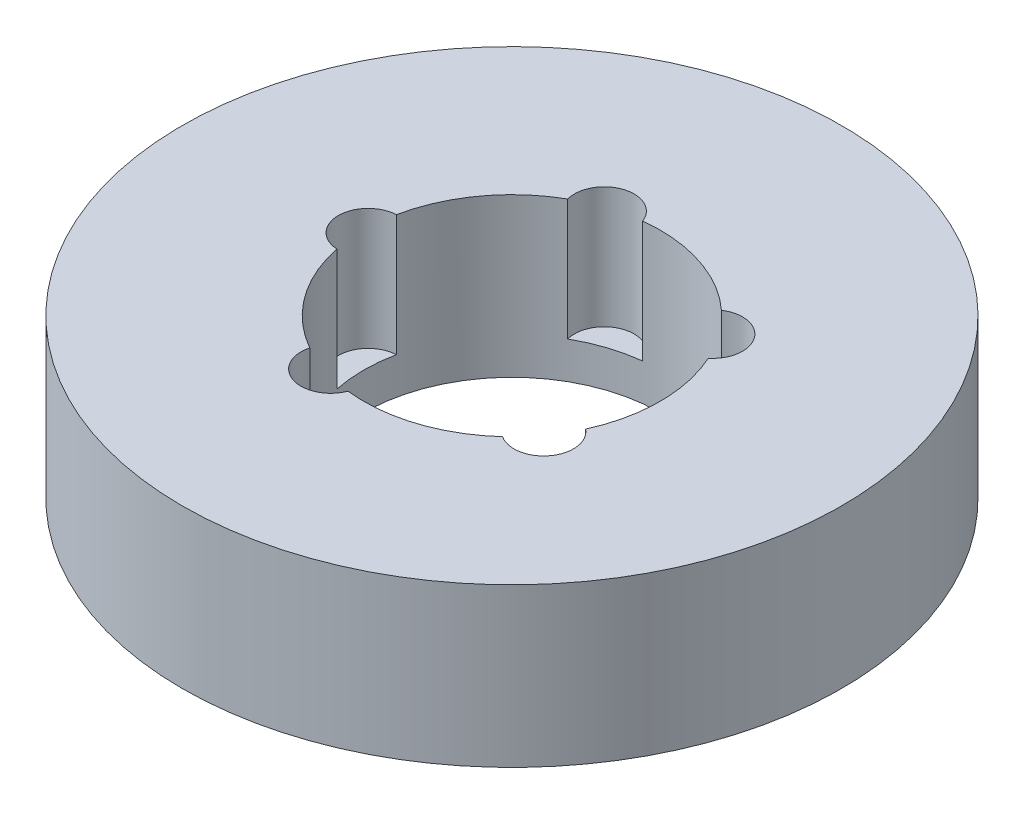
ISO-10303-21;
HEADER;
FILE_DESCRIPTION(('STEP AP214'),'2;1');
FILE_NAME('part.step','',(''),(''),'','','');
FILE_SCHEMA(('AUTOMOTIVE_DESIGN { 1 0 10303 214 1 1 1 1 }'));
ENDSEC;
DATA;
#1=APPLICATION_CONTEXT('core data for automotive mechanical design processes');
#2=APPLICATION_PROTOCOL_DEFINITION('international standard','automotive_design',2000,#1);
#3=PRODUCT_CONTEXT('',#1,'mechanical');
#4=PRODUCT('Part','Part','',(#3));
#5=PRODUCT_RELATED_PRODUCT_CATEGORY('part','',(#4));
#6=PRODUCT_DEFINITION_FORMATION('','',#4);
#7=PRODUCT_DEFINITION_CONTEXT('part definition',#1,'design');
#8=PRODUCT_DEFINITION('design','',#6,#7);
#9=PRODUCT_DEFINITION_SHAPE('','',#8);
#10=(LENGTH_UNIT() NAMED_UNIT(*) SI_UNIT(.MILLI.,.METRE.));
#11=(NAMED_UNIT(*) PLANE_ANGLE_UNIT() SI_UNIT($,.RADIAN.));
#12=(NAMED_UNIT(*) SI_UNIT($,.STERADIAN.) SOLID_ANGLE_UNIT());
#13=UNCERTAINTY_MEASURE_WITH_UNIT(LENGTH_MEASURE(1.E-05),#10,'distance_accuracy_value','');
#14=(GEOMETRIC_REPRESENTATION_CONTEXT(3) GLOBAL_UNCERTAINTY_ASSIGNED_CONTEXT((#13)) GLOBAL_UNIT_ASSIGNED_CONTEXT((#10,
#11,#12)) REPRESENTATION_CONTEXT('',''));
#15=CARTESIAN_POINT('',(0.,0.,0.));
#16=DIRECTION('',(0.,0.,1.));
#17=DIRECTION('',(1.,0.,0.));
#18=AXIS2_PLACEMENT_3D('',#15,#16,#17);
#19=CARTESIAN_POINT('',(0.,24.,0.));
#20=DIRECTION('',(0.,-1.,0.));
#21=DIRECTION('',(0.,0.,-1.));
#22=AXIS2_PLACEMENT_3D('',#19,#20,#21);
#23=CYLINDRICAL_SURFACE('',#22,50.);
#24=CARTESIAN_POINT('',(0.,24.,0.));
#25=DIRECTION('',(0.,1.,0.));
#26=DIRECTION('',(0.,0.,1.));
#27=AXIS2_PLACEMENT_3D('',#24,#25,#26);
#28=CIRCLE('',#27,50.);
#29=CARTESIAN_POINT('',(0.,24.,50.));
#30=VERTEX_POINT('',#29);
#31=EDGE_CURVE('E151',#30,#30,#28,.T.);
#32=ORIENTED_EDGE('',*,*,#31,.F.);
#33=EDGE_LOOP('',(#32));
#34=FACE_BOUND('',#33,.T.);
#35=CARTESIAN_POINT('',(0.,0.,0.));
#36=DIRECTION('',(0.,1.,0.));
#37=DIRECTION('',(0.,0.,1.));
#38=AXIS2_PLACEMENT_3D('',#35,#36,#37);
#39=CIRCLE('',#38,50.);
#40=CARTESIAN_POINT('',(0.,0.,50.));
#41=VERTEX_POINT('',#40);
#42=EDGE_CURVE('E150',#41,#41,#39,.T.);
#43=ORIENTED_EDGE('',*,*,#42,.T.);
#44=EDGE_LOOP('',(#43));
#45=FACE_BOUND('',#44,.T.);
#46=ADVANCED_FACE('F39',(#34,#45),#23,.T.);
#47=CARTESIAN_POINT('',(0.,24.,0.));
#48=DIRECTION('',(0.,1.,0.));
#49=DIRECTION('',(0.,0.,1.));
#50=AXIS2_PLACEMENT_3D('',#47,#48,#49);
#51=PLANE('',#50);
#52=CARTESIAN_POINT('',(-6.74144347513201,24.,-20.7480296002105));
#53=DIRECTION('',(0.,1.,0.));
#54=DIRECTION('',(-0.95105651629515,0.,0.309016994374958));
#55=AXIS2_PLACEMENT_3D('',#52,#53,#54);
#56=CIRCLE('',#55,4.51957308075142);
#57=CARTESIAN_POINT('',(-2.51857487786858,24.,-22.358595228336));
#58=VERTEX_POINT('',#57);
#59=CARTESIAN_POINT('',(-11.1044826593917,24.,-19.5688646800796));
#60=VERTEX_POINT('',#59);
#61=EDGE_CURVE('E196',#58,#60,#56,.T.);
#62=ORIENTED_EDGE('',*,*,#61,.F.);
#63=CARTESIAN_POINT('',(0.,24.,0.));
#64=DIRECTION('',(0.,1.,0.));
#65=DIRECTION('',(0.,0.,1.));
#66=AXIS2_PLACEMENT_3D('',#63,#64,#65);
#67=CIRCLE('',#66,22.5);
#68=CARTESIAN_POINT('',(15.1796224149939,24.,-16.6081023400693));
#69=VERTEX_POINT('',#68);
#70=EDGE_CURVE('E156',#69,#58,#67,.T.);
#71=ORIENTED_EDGE('',*,*,#70,.F.);
#72=CARTESIAN_POINT('',(17.6493281511311,24.,-12.8229874925192));
#73=DIRECTION('',(0.,1.,0.));
#74=DIRECTION('',(-0.58778525229248,0.,-0.809016994374942));
#75=AXIS2_PLACEMENT_3D('',#72,#73,#74);
#76=CIRCLE('',#75,4.51957308075142);
#77=CARTESIAN_POINT('',(20.4860052482475,24.,-9.30449294528056));
#78=VERTEX_POINT('',#77);
#79=EDGE_CURVE('E254',#78,#69,#76,.T.);
#80=ORIENTED_EDGE('',*,*,#79,.F.);
#81=CARTESIAN_POINT('',(20.4860052482476,24.,9.30449294528027));
#82=VERTEX_POINT('',#81);
#83=EDGE_CURVE('E153',#82,#78,#67,.T.);
#84=ORIENTED_EDGE('',*,*,#83,.F.);
#85=CARTESIAN_POINT('',(17.6493281511313,24.,12.8229874925189));
#86=DIRECTION('',(0.,1.,0.));
#87=DIRECTION('',(0.587785252292469,0.,-0.809016994374951));
#88=AXIS2_PLACEMENT_3D('',#85,#86,#87);
#89=CIRCLE('',#88,4.51957308075142);
#90=CARTESIAN_POINT('',(15.1796224149942,24.,16.6081023400691));
#91=VERTEX_POINT('',#90);
#92=EDGE_CURVE('E248',#91,#82,#89,.T.);
#93=ORIENTED_EDGE('',*,*,#92,.F.);
#94=CARTESIAN_POINT('',(-2.51857487786826,24.,22.358595228336));
#95=VERTEX_POINT('',#94);
#96=EDGE_CURVE('E140',#95,#91,#67,.T.);
#97=ORIENTED_EDGE('',*,*,#96,.F.);
#98=CARTESIAN_POINT('',(-6.74144347513171,24.,20.7480296002106));
#99=DIRECTION('',(0.,1.,0.));
#100=DIRECTION('',(0.951056516295155,0.,0.309016994374945));
#101=AXIS2_PLACEMENT_3D('',#98,#99,#100);
#102=CIRCLE('',#101,4.51957308075142);
#103=CARTESIAN_POINT('',(-11.1044826593914,24.,19.5688646800798));
#104=VERTEX_POINT('',#103);
#105=EDGE_CURVE('E117',#104,#95,#102,.T.);
#106=ORIENTED_EDGE('',*,*,#105,.F.);
#107=CARTESIAN_POINT('',(-22.0425701259818,24.,4.5138788465325));
#108=VERTEX_POINT('',#107);
#109=EDGE_CURVE('E133',#108,#104,#67,.T.);
#110=ORIENTED_EDGE('',*,*,#109,.F.);
#111=CARTESIAN_POINT('',(-21.8157693519988,24.,0.));
#112=DIRECTION('',(0.,1.,0.));
#113=DIRECTION('',(0.,0.,1.));
#114=AXIS2_PLACEMENT_3D('',#111,#112,#113);
#115=CIRCLE('',#114,4.51957308075142);
#116=CARTESIAN_POINT('',(-22.0425701259818,24.,-4.5138788465325));
#117=VERTEX_POINT('',#116);
#118=EDGE_CURVE('E170',#117,#108,#115,.T.);
#119=ORIENTED_EDGE('',*,*,#118,.F.);
#120=EDGE_CURVE('E149',#60,#117,#67,.T.);
#121=ORIENTED_EDGE('',*,*,#120,.F.);
#122=EDGE_LOOP('',(#62,#71,#80,#84,#93,#97,#106,#110,#119,#121));
#123=FACE_BOUND('',#122,.T.);
#124=ORIENTED_EDGE('',*,*,#31,.T.);
#125=EDGE_LOOP('',(#124));
#126=FACE_BOUND('',#125,.T.);
#127=ADVANCED_FACE('F131',(#123,#126),#51,.T.);
#128=CARTESIAN_POINT('',(0.,0.,0.));
#129=DIRECTION('',(0.,1.,0.));
#130=DIRECTION('',(0.,0.,1.));
#131=AXIS2_PLACEMENT_3D('',#128,#129,#130);
#132=PLANE('',#131);
#133=CARTESIAN_POINT('',(0.,0.,0.));
#134=DIRECTION('',(0.,1.,0.));
#135=DIRECTION('',(0.,0.,1.));
#136=AXIS2_PLACEMENT_3D('',#133,#134,#135);
#137=CIRCLE('',#136,22.5);
#138=CARTESIAN_POINT('',(0.,0.,22.5));
#139=VERTEX_POINT('',#138);
#140=EDGE_CURVE('E160',#139,#139,#137,.T.);
#141=ORIENTED_EDGE('',*,*,#140,.T.);
#142=EDGE_LOOP('',(#141));
#143=FACE_BOUND('',#142,.T.);
#144=ORIENTED_EDGE('',*,*,#42,.F.);
#145=EDGE_LOOP('',(#144));
#146=FACE_BOUND('',#145,.T.);
#147=ADVANCED_FACE('F212',(#143,#146),#132,.F.);
#148=CARTESIAN_POINT('',(0.,24.,0.));
#149=DIRECTION('',(0.,-1.,0.));
#150=DIRECTION('',(0.,0.,-1.));
#151=AXIS2_PLACEMENT_3D('',#148,#149,#150);
#152=CYLINDRICAL_SURFACE('',#151,22.5);
#153=DIRECTION('',(0.,1.,0.));
#154=VECTOR('',#153,1.);
#155=CARTESIAN_POINT('',(-2.51857487786858,14.802299616417,-22.358595228336));
#156=LINE('',#155,#154);
#157=CARTESIAN_POINT('',(-2.51857487786858,5.60459923283404,-22.358595228336));
#158=VERTEX_POINT('',#157);
#159=EDGE_CURVE('E11',#158,#58,#156,.T.);
#160=ORIENTED_EDGE('',*,*,#159,.F.);
#161=CARTESIAN_POINT('',(0.,5.60459923283404,0.));
#162=DIRECTION('',(0.,1.,0.));
#163=DIRECTION('',(0.,0.,1.));
#164=AXIS2_PLACEMENT_3D('',#161,#162,#163);
#165=CIRCLE('',#164,22.5);
#166=CARTESIAN_POINT('',(-11.1044826593917,5.60459923283404,-19.5688646800796));
#167=VERTEX_POINT('',#166);
#168=EDGE_CURVE('E193',#158,#167,#165,.T.);
#169=ORIENTED_EDGE('',*,*,#168,.T.);
#170=DIRECTION('',(0.,1.,0.));
#171=VECTOR('',#170,1.);
#172=CARTESIAN_POINT('',(-11.1044826593917,14.802299616417,-19.5688646800796));
#173=LINE('',#172,#171);
#174=EDGE_CURVE('E46',#60,#167,#173,.F.);
#175=ORIENTED_EDGE('',*,*,#174,.F.);
#176=ORIENTED_EDGE('',*,*,#120,.T.);
#177=DIRECTION('',(0.,1.,0.));
#178=VECTOR('',#177,1.);
#179=CARTESIAN_POINT('',(-22.0425701259818,14.802299616417,-4.5138788465325));
#180=LINE('',#179,#178);
#181=CARTESIAN_POINT('',(-22.0425701259818,5.60459923283404,-4.5138788465325));
#182=VERTEX_POINT('',#181);
#183=EDGE_CURVE('E174',#182,#117,#180,.T.);
#184=ORIENTED_EDGE('',*,*,#183,.F.);
#185=CARTESIAN_POINT('',(0.,5.60459923283404,0.));
#186=DIRECTION('',(0.,1.,0.));
#187=DIRECTION('',(0.,0.,1.));
#188=AXIS2_PLACEMENT_3D('',#185,#186,#187);
#189=CIRCLE('',#188,22.5);
#190=CARTESIAN_POINT('',(-22.0425701259818,5.60459923283404,4.5138788465325));
#191=VERTEX_POINT('',#190);
#192=EDGE_CURVE('E171',#182,#191,#189,.T.);
#193=ORIENTED_EDGE('',*,*,#192,.T.);
#194=DIRECTION('',(0.,1.,0.));
#195=VECTOR('',#194,1.);
#196=CARTESIAN_POINT('',(-22.0425701259818,14.802299616417,4.5138788465325));
#197=LINE('',#196,#195);
#198=EDGE_CURVE('E148',#108,#191,#197,.F.);
#199=ORIENTED_EDGE('',*,*,#198,.F.);
#200=ORIENTED_EDGE('',*,*,#109,.T.);
#201=DIRECTION('',(0.,1.,0.));
#202=VECTOR('',#201,1.);
#203=CARTESIAN_POINT('',(-11.1044826593914,14.802299616417,19.5688646800798));
#204=LINE('',#203,#202);
#205=CARTESIAN_POINT('',(-11.1044826593914,5.60459923283404,19.5688646800798));
#206=VERTEX_POINT('',#205);
#207=EDGE_CURVE('E111',#206,#104,#204,.T.);
#208=ORIENTED_EDGE('',*,*,#207,.F.);
#209=CARTESIAN_POINT('',(0.,5.60459923283404,0.));
#210=DIRECTION('',(0.,1.,0.));
#211=DIRECTION('',(0.,0.,1.));
#212=AXIS2_PLACEMENT_3D('',#209,#210,#211);
#213=CIRCLE('',#212,22.5);
#214=CARTESIAN_POINT('',(-2.51857487786826,5.60459923283404,22.358595228336));
#215=VERTEX_POINT('',#214);
#216=EDGE_CURVE('E180',#206,#215,#213,.T.);
#217=ORIENTED_EDGE('',*,*,#216,.T.);
#218=DIRECTION('',(0.,1.,0.));
#219=VECTOR('',#218,1.);
#220=CARTESIAN_POINT('',(-2.51857487786826,14.802299616417,22.358595228336));
#221=LINE('',#220,#219);
#222=EDGE_CURVE('E124',#95,#215,#221,.F.);
#223=ORIENTED_EDGE('',*,*,#222,.F.);
#224=ORIENTED_EDGE('',*,*,#96,.T.);
#225=DIRECTION('',(0.,1.,0.));
#226=VECTOR('',#225,1.);
#227=CARTESIAN_POINT('',(15.1796224149942,14.802299616417,16.608102340069));
#228=LINE('',#227,#226);
#229=CARTESIAN_POINT('',(15.1796224149942,5.60459923283404,16.6081023400691));
#230=VERTEX_POINT('',#229);
#231=EDGE_CURVE('E183',#230,#91,#228,.T.);
#232=ORIENTED_EDGE('',*,*,#231,.F.);
#233=CARTESIAN_POINT('',(0.,5.60459923283404,0.));
#234=DIRECTION('',(0.,1.,0.));
#235=DIRECTION('',(0.,0.,1.));
#236=AXIS2_PLACEMENT_3D('',#233,#234,#235);
#237=CIRCLE('',#236,22.5);
#238=CARTESIAN_POINT('',(20.4860052482476,5.60459923283404,9.30449294528027));
#239=VERTEX_POINT('',#238);
#240=EDGE_CURVE('E123',#230,#239,#237,.T.);
#241=ORIENTED_EDGE('',*,*,#240,.T.);
#242=DIRECTION('',(0.,1.,0.));
#243=VECTOR('',#242,1.);
#244=CARTESIAN_POINT('',(20.4860052482476,14.802299616417,9.30449294528026));
#245=LINE('',#244,#243);
#246=EDGE_CURVE('E185',#82,#239,#245,.F.);
#247=ORIENTED_EDGE('',*,*,#246,.F.);
#248=ORIENTED_EDGE('',*,*,#83,.T.);
#249=DIRECTION('',(0.,1.,0.));
#250=VECTOR('',#249,1.);
#251=CARTESIAN_POINT('',(20.4860052482475,14.802299616417,-9.30449294528056));
#252=LINE('',#251,#250);
#253=CARTESIAN_POINT('',(20.4860052482475,5.60459923283404,-9.30449294528056));
#254=VERTEX_POINT('',#253);
#255=EDGE_CURVE('E195',#254,#78,#252,.T.);
#256=ORIENTED_EDGE('',*,*,#255,.F.);
#257=CARTESIAN_POINT('',(0.,5.60459923283404,0.));
#258=DIRECTION('',(0.,1.,0.));
#259=DIRECTION('',(0.,0.,1.));
#260=AXIS2_PLACEMENT_3D('',#257,#258,#259);
#261=CIRCLE('',#260,22.5);
#262=CARTESIAN_POINT('',(15.1796224149939,5.60459923283404,-16.6081023400693));
#263=VERTEX_POINT('',#262);
#264=EDGE_CURVE('E190',#254,#263,#261,.T.);
#265=ORIENTED_EDGE('',*,*,#264,.T.);
#266=DIRECTION('',(0.,1.,0.));
#267=VECTOR('',#266,1.);
#268=CARTESIAN_POINT('',(15.1796224149939,14.802299616417,-16.6081023400693));
#269=LINE('',#268,#267);
#270=EDGE_CURVE('E189',#69,#263,#269,.F.);
#271=ORIENTED_EDGE('',*,*,#270,.F.);
#272=ORIENTED_EDGE('',*,*,#70,.T.);
#273=EDGE_LOOP('',(#160,#169,#175,#176,#184,#193,#199,#200,#208,#217,#223,#224,#232,#241,#247,
#248,#256,#265,#271,#272));
#274=FACE_BOUND('',#273,.T.);
#275=ORIENTED_EDGE('',*,*,#140,.F.);
#276=EDGE_LOOP('',(#275));
#277=FACE_BOUND('',#276,.T.);
#278=ADVANCED_FACE('F142',(#274,#277),#152,.F.);
#279=CARTESIAN_POINT('',(-21.8157693519988,5.60459923283404,0.));
#280=DIRECTION('',(0.,1.,0.));
#281=DIRECTION('',(0.,0.,1.));
#282=AXIS2_PLACEMENT_3D('',#279,#280,#281);
#283=CYLINDRICAL_SURFACE('',#282,4.51957308075142);
#284=ORIENTED_EDGE('',*,*,#183,.T.);
#285=ORIENTED_EDGE('',*,*,#118,.T.);
#286=ORIENTED_EDGE('',*,*,#198,.T.);
#287=CARTESIAN_POINT('',(-21.8157693519988,5.60459923283404,0.));
#288=DIRECTION('',(0.,1.,0.));
#289=DIRECTION('',(0.,0.,1.));
#290=AXIS2_PLACEMENT_3D('',#287,#288,#289);
#291=CIRCLE('',#290,4.51957308075142);
#292=EDGE_CURVE('E163',#182,#191,#291,.T.);
#293=ORIENTED_EDGE('',*,*,#292,.F.);
#294=EDGE_LOOP('',(#284,#285,#286,#293));
#295=FACE_BOUND('',#294,.T.);
#296=ADVANCED_FACE('F221',(#295),#283,.F.);
#297=CARTESIAN_POINT('',(-21.8157693519988,5.60459923283404,0.));
#298=DIRECTION('',(0.,1.,0.));
#299=DIRECTION('',(0.,0.,1.));
#300=AXIS2_PLACEMENT_3D('',#297,#298,#299);
#301=PLANE('',#300);
#302=ORIENTED_EDGE('',*,*,#292,.T.);
#303=ORIENTED_EDGE('',*,*,#192,.F.);
#304=EDGE_LOOP('',(#302,#303));
#305=FACE_BOUND('',#304,.T.);
#306=ADVANCED_FACE('F227',(#305),#301,.T.);
#307=CARTESIAN_POINT('',(-6.74144347513171,5.60459923283404,20.7480296002106));
#308=DIRECTION('',(0.,1.,0.));
#309=DIRECTION('',(0.,0.,1.));
#310=AXIS2_PLACEMENT_3D('',#307,#308,#309);
#311=CYLINDRICAL_SURFACE('',#310,4.51957308075142);
#312=ORIENTED_EDGE('',*,*,#207,.T.);
#313=ORIENTED_EDGE('',*,*,#105,.T.);
#314=ORIENTED_EDGE('',*,*,#222,.T.);
#315=CARTESIAN_POINT('',(-6.74144347513171,5.60459923283404,20.7480296002106));
#316=DIRECTION('',(0.,1.,0.));
#317=DIRECTION('',(0.951056516295155,0.,0.309016994374945));
#318=AXIS2_PLACEMENT_3D('',#315,#316,#317);
#319=CIRCLE('',#318,4.51957308075142);
#320=EDGE_CURVE('E119',#206,#215,#319,.T.);
#321=ORIENTED_EDGE('',*,*,#320,.F.);
#322=EDGE_LOOP('',(#312,#313,#314,#321));
#323=FACE_BOUND('',#322,.T.);
#324=ADVANCED_FACE('F116',(#323),#311,.F.);
#325=CARTESIAN_POINT('',(-6.74144347513171,5.60459923283404,20.7480296002106));
#326=DIRECTION('',(0.,1.,0.));
#327=DIRECTION('',(0.951056516295155,0.,0.309016994374945));
#328=AXIS2_PLACEMENT_3D('',#325,#326,#327);
#329=PLANE('',#328);
#330=ORIENTED_EDGE('',*,*,#320,.T.);
#331=ORIENTED_EDGE('',*,*,#216,.F.);
#332=EDGE_LOOP('',(#330,#331));
#333=FACE_BOUND('',#332,.T.);
#334=ADVANCED_FACE('F234',(#333),#329,.T.);
#335=CARTESIAN_POINT('',(17.6493281511313,5.60459923283404,12.8229874925189));
#336=DIRECTION('',(0.,1.,0.));
#337=DIRECTION('',(0.,0.,1.));
#338=AXIS2_PLACEMENT_3D('',#335,#336,#337);
#339=CYLINDRICAL_SURFACE('',#338,4.51957308075142);
#340=ORIENTED_EDGE('',*,*,#231,.T.);
#341=ORIENTED_EDGE('',*,*,#92,.T.);
#342=ORIENTED_EDGE('',*,*,#246,.T.);
#343=CARTESIAN_POINT('',(17.6493281511313,5.60459923283404,12.8229874925189));
#344=DIRECTION('',(0.,1.,0.));
#345=DIRECTION('',(0.587785252292469,0.,-0.809016994374951));
#346=AXIS2_PLACEMENT_3D('',#343,#344,#345);
#347=CIRCLE('',#346,4.51957308075142);
#348=EDGE_CURVE('E137',#230,#239,#347,.T.);
#349=ORIENTED_EDGE('',*,*,#348,.F.);
#350=EDGE_LOOP('',(#340,#341,#342,#349));
#351=FACE_BOUND('',#350,.T.);
#352=ADVANCED_FACE('F240',(#351),#339,.F.);
#353=CARTESIAN_POINT('',(17.6493281511313,5.60459923283404,12.8229874925189));
#354=DIRECTION('',(0.,1.,0.));
#355=DIRECTION('',(0.587785252292469,0.,-0.809016994374951));
#356=AXIS2_PLACEMENT_3D('',#353,#354,#355);
#357=PLANE('',#356);
#358=ORIENTED_EDGE('',*,*,#348,.T.);
#359=ORIENTED_EDGE('',*,*,#240,.F.);
#360=EDGE_LOOP('',(#358,#359));
#361=FACE_BOUND('',#360,.T.);
#362=ADVANCED_FACE('F245',(#361),#357,.T.);
#363=CARTESIAN_POINT('',(17.6493281511311,5.60459923283404,-12.8229874925192));
#364=DIRECTION('',(0.,1.,0.));
#365=DIRECTION('',(0.,0.,1.));
#366=AXIS2_PLACEMENT_3D('',#363,#364,#365);
#367=CYLINDRICAL_SURFACE('',#366,4.51957308075142);
#368=ORIENTED_EDGE('',*,*,#255,.T.);
#369=ORIENTED_EDGE('',*,*,#79,.T.);
#370=ORIENTED_EDGE('',*,*,#270,.T.);
#371=CARTESIAN_POINT('',(17.6493281511311,5.60459923283404,-12.8229874925192));
#372=DIRECTION('',(0.,1.,0.));
#373=DIRECTION('',(-0.58778525229248,0.,-0.809016994374942));
#374=AXIS2_PLACEMENT_3D('',#371,#372,#373);
#375=CIRCLE('',#374,4.51957308075142);
#376=EDGE_CURVE('E56',#254,#263,#375,.T.);
#377=ORIENTED_EDGE('',*,*,#376,.F.);
#378=EDGE_LOOP('',(#368,#369,#370,#377));
#379=FACE_BOUND('',#378,.T.);
#380=ADVANCED_FACE('F264',(#379),#367,.F.);
#381=CARTESIAN_POINT('',(17.6493281511311,5.60459923283404,-12.8229874925192));
#382=DIRECTION('',(0.,1.,0.));
#383=DIRECTION('',(-0.58778525229248,0.,-0.809016994374942));
#384=AXIS2_PLACEMENT_3D('',#381,#382,#383);
#385=PLANE('',#384);
#386=ORIENTED_EDGE('',*,*,#376,.T.);
#387=ORIENTED_EDGE('',*,*,#264,.F.);
#388=EDGE_LOOP('',(#386,#387));
#389=FACE_BOUND('',#388,.T.);
#390=ADVANCED_FACE('F202',(#389),#385,.T.);
#391=CARTESIAN_POINT('',(-6.74144347513201,5.60459923283404,-20.7480296002105));
#392=DIRECTION('',(0.,1.,0.));
#393=DIRECTION('',(0.,0.,1.));
#394=AXIS2_PLACEMENT_3D('',#391,#392,#393);
#395=CYLINDRICAL_SURFACE('',#394,4.51957308075142);
#396=ORIENTED_EDGE('',*,*,#159,.T.);
#397=ORIENTED_EDGE('',*,*,#61,.T.);
#398=ORIENTED_EDGE('',*,*,#174,.T.);
#399=CARTESIAN_POINT('',(-6.74144347513201,5.60459923283404,-20.7480296002105));
#400=DIRECTION('',(0.,1.,0.));
#401=DIRECTION('',(-0.95105651629515,0.,0.309016994374958));
#402=AXIS2_PLACEMENT_3D('',#399,#400,#401);
#403=CIRCLE('',#402,4.51957308075142);
#404=EDGE_CURVE('E55',#158,#167,#403,.T.);
#405=ORIENTED_EDGE('',*,*,#404,.F.);
#406=EDGE_LOOP('',(#396,#397,#398,#405));
#407=FACE_BOUND('',#406,.T.);
#408=ADVANCED_FACE('F197',(#407),#395,.F.);
#409=CARTESIAN_POINT('',(-6.74144347513201,5.60459923283404,-20.7480296002105));
#410=DIRECTION('',(0.,1.,0.));
#411=DIRECTION('',(-0.95105651629515,0.,0.309016994374958));
#412=AXIS2_PLACEMENT_3D('',#409,#410,#411);
#413=PLANE('',#412);
#414=ORIENTED_EDGE('',*,*,#404,.T.);
#415=ORIENTED_EDGE('',*,*,#168,.F.);
#416=EDGE_LOOP('',(#414,#415));
#417=FACE_BOUND('',#416,.T.);
#418=ADVANCED_FACE('F200',(#417),#413,.T.);
#419=CLOSED_SHELL('',(#46,#127,#147,#278,#296,#306,#324,#334,#352,#362,#380,#390,#408,#418));
#420=MANIFOLD_SOLID_BREP('B2',#419);
#421=ADVANCED_BREP_SHAPE_REPRESENTATION('',(#18,#420),#14);
#422=SHAPE_DEFINITION_REPRESENTATION(#9,#421);
ENDSEC;
END-ISO-10303-21;
